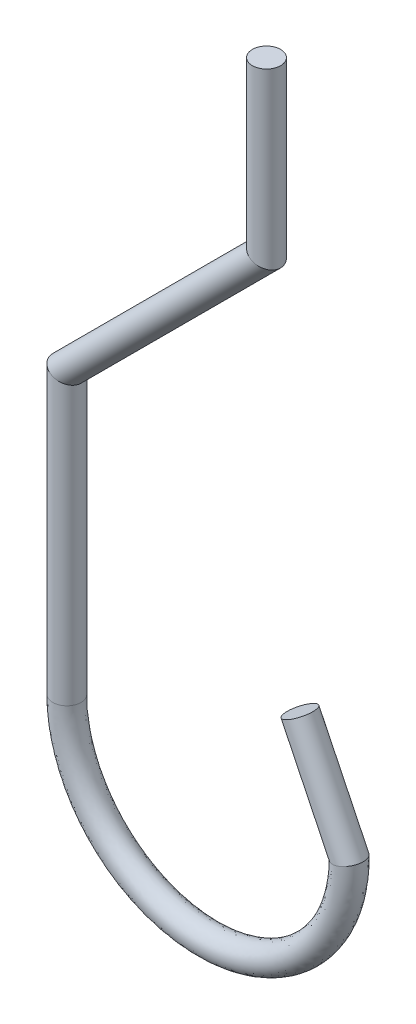
ISO-10303-21;
HEADER;
FILE_DESCRIPTION(('STEP AP214'),'2;1');
FILE_NAME('part.step','',(''),(''),'','','');
FILE_SCHEMA(('AUTOMOTIVE_DESIGN { 1 0 10303 214 1 1 1 1 }'));
ENDSEC;
DATA;
#1=APPLICATION_CONTEXT('core data for automotive mechanical design processes');
#2=APPLICATION_PROTOCOL_DEFINITION('international standard','automotive_design',2000,#1);
#3=PRODUCT_CONTEXT('',#1,'mechanical');
#4=PRODUCT('Part','Part','',(#3));
#5=PRODUCT_RELATED_PRODUCT_CATEGORY('part','',(#4));
#6=PRODUCT_DEFINITION_FORMATION('','',#4);
#7=PRODUCT_DEFINITION_CONTEXT('part definition',#1,'design');
#8=PRODUCT_DEFINITION('design','',#6,#7);
#9=PRODUCT_DEFINITION_SHAPE('','',#8);
#10=(LENGTH_UNIT() NAMED_UNIT(*) SI_UNIT(.MILLI.,.METRE.));
#11=(NAMED_UNIT(*) PLANE_ANGLE_UNIT() SI_UNIT($,.RADIAN.));
#12=(NAMED_UNIT(*) SI_UNIT($,.STERADIAN.) SOLID_ANGLE_UNIT());
#13=UNCERTAINTY_MEASURE_WITH_UNIT(LENGTH_MEASURE(1.E-05),#10,'distance_accuracy_value','');
#14=(GEOMETRIC_REPRESENTATION_CONTEXT(3) GLOBAL_UNCERTAINTY_ASSIGNED_CONTEXT((#13)) GLOBAL_UNIT_ASSIGNED_CONTEXT((#10,
#11,#12)) REPRESENTATION_CONTEXT('',''));
#15=CARTESIAN_POINT('',(0.,0.,0.));
#16=DIRECTION('',(0.,0.,1.));
#17=DIRECTION('',(1.,0.,0.));
#18=AXIS2_PLACEMENT_3D('',#15,#16,#17);
#19=CARTESIAN_POINT('',(-35.3553390593274,-65.3553390593273,0.));
#20=DIRECTION('',(0.,-1.,0.));
#21=DIRECTION('',(1.,0.,0.));
#22=AXIS2_PLACEMENT_3D('',#19,#20,#21);
#23=CYLINDRICAL_SURFACE('',#22,2.5);
#24=CARTESIAN_POINT('',(-35.3553390593274,-65.3553390593273,0.));
#25=DIRECTION('',(-0.382683432365091,-0.923879532511286,0.));
#26=DIRECTION('',(-0.923879532511286,0.382683432365091,0.));
#27=AXIS2_PLACEMENT_3D('',#24,#25,#26);
#28=ELLIPSE('',#27,2.70598050073099,2.5);
#29=CARTESIAN_POINT('',(-37.8553390593274,-64.3198051533946,0.));
#30=VERTEX_POINT('',#29);
#31=EDGE_CURVE('E12',#30,#30,#28,.T.);
#32=ORIENTED_EDGE('',*,*,#31,.T.);
#33=EDGE_LOOP('',(#32));
#34=FACE_BOUND('',#33,.T.);
#35=CARTESIAN_POINT('',(-35.3553390593274,-115.355339059327,0.));
#36=DIRECTION('',(0.,-1.,0.));
#37=DIRECTION('',(1.,0.,0.));
#38=AXIS2_PLACEMENT_3D('',#35,#36,#37);
#39=CIRCLE('',#38,2.5);
#40=CARTESIAN_POINT('',(-32.8553390593274,-115.355339059327,0.));
#41=VERTEX_POINT('',#40);
#42=EDGE_CURVE('E53',#41,#41,#39,.F.);
#43=ORIENTED_EDGE('',*,*,#42,.T.);
#44=EDGE_LOOP('',(#43));
#45=FACE_BOUND('',#44,.T.);
#46=ADVANCED_FACE('F39',(#34,#45),#23,.T.);
#47=CARTESIAN_POINT('',(0.,-30.,0.));
#48=DIRECTION('',(-0.707106781186549,-0.707106781186546,0.));
#49=DIRECTION('',(0.707106781186546,-0.707106781186549,0.));
#50=AXIS2_PLACEMENT_3D('',#47,#48,#49);
#51=CYLINDRICAL_SURFACE('',#50,2.5);
#52=CARTESIAN_POINT('',(0.,-30.,0.));
#53=DIRECTION('',(-0.382683432365091,-0.923879532511286,0.));
#54=DIRECTION('',(-0.923879532511286,0.382683432365091,0.));
#55=AXIS2_PLACEMENT_3D('',#52,#53,#54);
#56=ELLIPSE('',#55,2.70598050073099,2.5);
#57=CARTESIAN_POINT('',(-2.5,-28.9644660940673,0.));
#58=VERTEX_POINT('',#57);
#59=EDGE_CURVE('E45',#58,#58,#56,.F.);
#60=ORIENTED_EDGE('',*,*,#59,.F.);
#61=EDGE_LOOP('',(#60));
#62=FACE_BOUND('',#61,.T.);
#63=ORIENTED_EDGE('',*,*,#31,.F.);
#64=EDGE_LOOP('',(#63));
#65=FACE_BOUND('',#64,.T.);
#66=ADVANCED_FACE('F86',(#62,#65),#51,.T.);
#67=CARTESIAN_POINT('',(0.,0.,0.));
#68=DIRECTION('',(0.,1.,0.));
#69=DIRECTION('',(0.,0.,1.));
#70=AXIS2_PLACEMENT_3D('',#67,#68,#69);
#71=PLANE('',#70);
#72=CARTESIAN_POINT('',(0.,0.,0.));
#73=DIRECTION('',(0.,1.,0.));
#74=DIRECTION('',(0.,0.,1.));
#75=AXIS2_PLACEMENT_3D('',#72,#73,#74);
#76=CIRCLE('',#75,2.5);
#77=CARTESIAN_POINT('',(0.,0.,2.5));
#78=VERTEX_POINT('',#77);
#79=EDGE_CURVE('E49',#78,#78,#76,.T.);
#80=ORIENTED_EDGE('',*,*,#79,.T.);
#81=EDGE_LOOP('',(#80));
#82=FACE_BOUND('',#81,.T.);
#83=ADVANCED_FACE('F90',(#82),#71,.T.);
#84=CARTESIAN_POINT('',(0.,-37.0710678118655,0.));
#85=DIRECTION('',(0.,1.,0.));
#86=DIRECTION('',(-1.,0.,0.));
#87=AXIS2_PLACEMENT_3D('',#84,#85,#86);
#88=CYLINDRICAL_SURFACE('',#87,2.5);
#89=ORIENTED_EDGE('',*,*,#79,.F.);
#90=EDGE_LOOP('',(#89));
#91=FACE_BOUND('',#90,.T.);
#92=ORIENTED_EDGE('',*,*,#59,.T.);
#93=EDGE_LOOP('',(#92));
#94=FACE_BOUND('',#93,.T.);
#95=ADVANCED_FACE('F82',(#91,#94),#88,.T.);
#96=CARTESIAN_POINT('',(-32.8553390593274,-115.355339059327,0.));
#97=CARTESIAN_POINT('',(-32.8553390593274,-116.464848793491,0.));
#98=CARTESIAN_POINT('',(-32.7194137170249,-118.386805336152,0.));
#99=CARTESIAN_POINT('',(-32.0227368202156,-121.779781778348,0.));
#100=CARTESIAN_POINT('',(-30.664552408539,-125.310970364232,0.));
#101=CARTESIAN_POINT('',(-28.6263524869329,-128.691075626193,0.));
#102=CARTESIAN_POINT('',(-25.9955369547515,-131.674877767429,0.));
#103=CARTESIAN_POINT('',(-22.8984379080597,-134.184129596817,0.));
#104=CARTESIAN_POINT('',(-19.2158316555929,-136.185655723992,0.));
#105=CARTESIAN_POINT('',(-15.0600798109605,-137.507119957329,0.));
#106=CARTESIAN_POINT('',(-10.6402734723069,-138.002916728591,0.));
#107=CARTESIAN_POINT('',(-6.20933990120271,-137.61901563494,0.));
#108=CARTESIAN_POINT('',(-2.02172192830086,-136.403197176913,0.));
#109=CARTESIAN_POINT('',(1.71143063672208,-134.497284427214,0.));
#110=CARTESIAN_POINT('',(4.8696812389129,-132.065899606383,0.));
#111=CARTESIAN_POINT('',(7.57671904738378,-129.151003226611,0.));
#112=CARTESIAN_POINT('',(9.69825481593618,-125.823707610864,0.));
#113=CARTESIAN_POINT('',(11.1522833885691,-122.328860904178,0.));
#114=CARTESIAN_POINT('',(11.9158990143476,-118.954595111176,0.));
#115=CARTESIAN_POINT('',(12.1446609406726,-117.038665142671,0.));
#116=CARTESIAN_POINT('',(12.1446609406726,-115.928878394004,0.));
#117=CARTESIAN_POINT('',(-32.8553390593274,-115.355339059327,-5.));
#118=CARTESIAN_POINT('',(-32.8553390593274,-116.828750929578,-5.));
#119=CARTESIAN_POINT('',(-32.7194137170249,-118.195887177735,-5.));
#120=CARTESIAN_POINT('',(-32.0227368202157,-121.841101993456,-5.));
#121=CARTESIAN_POINT('',(-30.664552408539,-125.291406751237,-5.));
#122=CARTESIAN_POINT('',(-28.6263524869329,-128.695809373312,-5.));
#123=CARTESIAN_POINT('',(-25.9955369547515,-131.673589751497,-5.));
#124=CARTESIAN_POINT('',(-22.8984379080597,-134.184506177063,-5.));
#125=CARTESIAN_POINT('',(-19.2158316555929,-136.185547511496,-5.));
#126=CARTESIAN_POINT('',(-15.0600798109606,-137.50715206661,-5.));
#127=CARTESIAN_POINT('',(-10.6402734723069,-138.00290048849,-5.));
#128=CARTESIAN_POINT('',(-6.20933990120272,-137.619047851515,-5.));
#129=CARTESIAN_POINT('',(-2.02172192830085,-136.403088548053,-5.));
#130=CARTESIAN_POINT('',(1.71143063672207,-134.497662484088,-5.));
#131=CARTESIAN_POINT('',(4.8696812389129,-132.064606496469,-5.));
#132=CARTESIAN_POINT('',(7.57671904738378,-129.15575591048,-5.));
#133=CARTESIAN_POINT('',(9.69825481593619,-125.804065075985,-5.));
#134=CARTESIAN_POINT('',(11.1522833885692,-122.390430284786,-5.));
#135=CARTESIAN_POINT('',(11.9158990143476,-118.762895815371,-5.00000000000001));
#136=CARTESIAN_POINT('',(12.1446609406726,-117.404059878969,-5.));
#137=CARTESIAN_POINT('',(12.1446609406726,-115.928878394004,-5.));
#138=CARTESIAN_POINT('',(-37.8553390593274,-115.355339059327,-5.));
#139=CARTESIAN_POINT('',(-37.8553390593274,-116.828750929578,-5.));
#140=CARTESIAN_POINT('',(-37.6816464963877,-119.084800699733,-5.));
#141=CARTESIAN_POINT('',(-36.8004159575366,-123.362391518535,-5.));
#142=CARTESIAN_POINT('',(-35.0856174538301,-127.711896900218,-5.));
#143=CARTESIAN_POINT('',(-32.5288284371956,-131.877159421217,-5.));
#144=CARTESIAN_POINT('',(-29.2120798843926,-135.552398624968,-5.));
#145=CARTESIAN_POINT('',(-25.3449499044455,-138.597225616344,-5.));
#146=CARTESIAN_POINT('',(-20.7277910849168,-141.009375206802,-5.));
#147=CARTESIAN_POINT('',(-15.552334221332,-142.54488390356,-5.));
#148=CARTESIAN_POINT('',(-10.0703504115713,-143.040352597145,-5.));
#149=CARTESIAN_POINT('',(-4.59948620972261,-142.432967200906,-5.));
#150=CARTESIAN_POINT('',(0.544123308218047,-140.791774542062,-5.));
#151=CARTESIAN_POINT('',(5.11065628358608,-138.284036966686,-5.));
#152=CARTESIAN_POINT('',(8.91668613776802,-135.16127062822,-5.));
#153=CARTESIAN_POINT('',(12.1571672557414,-131.417171279379,-5.));
#154=CARTESIAN_POINT('',(14.6305954083067,-127.198977671471,-5.));
#155=CARTESIAN_POINT('',(16.2495396905664,-122.813563410938,-5.));
#156=CARTESIAN_POINT('',(17.0638081258829,-118.515900665807,-4.99999999999999));
#157=CARTESIAN_POINT('',(17.1446609406725,-116.256981209616,-5.));
#158=CARTESIAN_POINT('',(17.1446609406725,-114.781799724651,-5.));
#159=CARTESIAN_POINT('',(-37.8553390593274,-115.355339059327,0.));
#160=CARTESIAN_POINT('',(-37.8553390593274,-116.646799861534,0.));
#161=CARTESIAN_POINT('',(-37.6816464963877,-119.180259778942,0.));
#162=CARTESIAN_POINT('',(-36.8004159575367,-123.331731410981,0.));
#163=CARTESIAN_POINT('',(-35.0856174538301,-127.721678706716,0.));
#164=CARTESIAN_POINT('',(-32.5288284371956,-131.874792547657,0.));
#165=CARTESIAN_POINT('',(-29.2120798843927,-135.553042632933,0.));
#166=CARTESIAN_POINT('',(-25.3449499044455,-138.597037326221,0.));
#167=CARTESIAN_POINT('',(-20.7277910849167,-141.009429313049,0.));
#168=CARTESIAN_POINT('',(-15.552334221332,-142.544867848919,0.));
#169=CARTESIAN_POINT('',(-10.0703504115713,-143.040360717195,0.));
#170=CARTESIAN_POINT('',(-4.59948620972261,-142.432951092619,0.));
#171=CARTESIAN_POINT('',(0.544123308218034,-140.791828856492,0.));
#172=CARTESIAN_POINT('',(5.11065628358611,-138.283847938249,0.));
#173=CARTESIAN_POINT('',(8.91668613776801,-135.161917183177,0.));
#174=CARTESIAN_POINT('',(12.1571672557414,-131.414794937445,0.));
#175=CARTESIAN_POINT('',(14.6305954083067,-127.20879893891,0.));
#176=CARTESIAN_POINT('',(16.2495396905664,-122.782778720634,0.));
#177=CARTESIAN_POINT('',(17.063808125883,-118.611750313709,0.));
#178=CARTESIAN_POINT('',(17.1446609406725,-116.074283841467,0.));
#179=CARTESIAN_POINT('',(17.1446609406725,-114.781799724651,0.));
#180=CARTESIAN_POINT('',(-37.8553390593274,-115.355339059327,5.));
#181=CARTESIAN_POINT('',(-37.8553390593274,-116.464848793491,5.));
#182=CARTESIAN_POINT('',(-37.6816464963877,-119.27571885815,5.));
#183=CARTESIAN_POINT('',(-36.8004159575366,-123.301071303427,5.));
#184=CARTESIAN_POINT('',(-35.0856174538301,-127.731460513213,5.));
#185=CARTESIAN_POINT('',(-32.5288284371956,-131.872425674097,5.));
#186=CARTESIAN_POINT('',(-29.2120798843926,-135.553686640899,5.));
#187=CARTESIAN_POINT('',(-25.3449499044455,-138.596849036098,5.));
#188=CARTESIAN_POINT('',(-20.7277910849168,-141.009483419297,5.));
#189=CARTESIAN_POINT('',(-15.552334221332,-142.544851794278,5.));
#190=CARTESIAN_POINT('',(-10.0703504115713,-143.040368837245,5.));
#191=CARTESIAN_POINT('',(-4.59948620972261,-142.432934984331,5.));
#192=CARTESIAN_POINT('',(0.544123308218047,-140.791883170922,5.));
#193=CARTESIAN_POINT('',(5.11065628358608,-138.283658909812,5.));
#194=CARTESIAN_POINT('',(8.91668613776802,-135.162563738134,5.));
#195=CARTESIAN_POINT('',(12.1571672557414,-131.412418595511,5.));
#196=CARTESIAN_POINT('',(14.6305954083067,-127.21862020635,5.));
#197=CARTESIAN_POINT('',(16.2495396905664,-122.75199403033,5.));
#198=CARTESIAN_POINT('',(17.0638081258829,-118.707599961612,5.00000000000001));
#199=CARTESIAN_POINT('',(17.1446609406725,-115.891586473318,5.));
#200=CARTESIAN_POINT('',(17.1446609406725,-114.781799724651,5.));
#201=CARTESIAN_POINT('',(-32.8553390593274,-115.355339059327,5.));
#202=CARTESIAN_POINT('',(-32.8553390593274,-116.100946657404,5.));
#203=CARTESIAN_POINT('',(-32.7194137170249,-118.577723494568,5.));
#204=CARTESIAN_POINT('',(-32.0227368202157,-121.71846156324,5.));
#205=CARTESIAN_POINT('',(-30.664552408539,-125.330533977226,5.));
#206=CARTESIAN_POINT('',(-28.6263524869329,-128.686341879074,5.));
#207=CARTESIAN_POINT('',(-25.9955369547515,-131.67616578336,5.));
#208=CARTESIAN_POINT('',(-22.8984379080597,-134.183753016571,5.));
#209=CARTESIAN_POINT('',(-19.2158316555929,-136.185763936487,5.));
#210=CARTESIAN_POINT('',(-15.0600798109606,-137.507087848047,5.));
#211=CARTESIAN_POINT('',(-10.6402734723069,-138.002932968691,5.));
#212=CARTESIAN_POINT('',(-6.20933990120272,-137.618983418365,5.));
#213=CARTESIAN_POINT('',(-2.02172192830085,-136.403305805773,5.));
#214=CARTESIAN_POINT('',(1.71143063672207,-134.49690637034,5.));
#215=CARTESIAN_POINT('',(4.8696812389129,-132.067192716297,5.));
#216=CARTESIAN_POINT('',(7.57671904738378,-129.146250542742,5.));
#217=CARTESIAN_POINT('',(9.69825481593619,-125.843350145743,5.));
#218=CARTESIAN_POINT('',(11.1522833885692,-122.267291523569,5.));
#219=CARTESIAN_POINT('',(11.9158990143476,-119.14629440698,4.99999999999999));
#220=CARTESIAN_POINT('',(12.1446609406726,-116.673270406373,5.));
#221=CARTESIAN_POINT('',(12.1446609406726,-115.928878394004,5.));
#222=CARTESIAN_POINT('',(-32.8553390593274,-115.355339059327,0.));
#223=CARTESIAN_POINT('',(-32.8553390593274,-116.464848793491,0.));
#224=CARTESIAN_POINT('',(-32.7194137170249,-118.386805336152,0.));
#225=CARTESIAN_POINT('',(-32.0227368202156,-121.779781778348,0.));
#226=CARTESIAN_POINT('',(-30.664552408539,-125.310970364232,0.));
#227=CARTESIAN_POINT('',(-28.6263524869329,-128.691075626193,0.));
#228=CARTESIAN_POINT('',(-25.9955369547515,-131.674877767429,0.));
#229=CARTESIAN_POINT('',(-22.8984379080597,-134.184129596817,0.));
#230=CARTESIAN_POINT('',(-19.2158316555929,-136.185655723992,0.));
#231=CARTESIAN_POINT('',(-15.0600798109605,-137.507119957329,0.));
#232=CARTESIAN_POINT('',(-10.6402734723069,-138.002916728591,0.));
#233=CARTESIAN_POINT('',(-6.20933990120271,-137.61901563494,0.));
#234=CARTESIAN_POINT('',(-2.02172192830086,-136.403197176913,0.));
#235=CARTESIAN_POINT('',(1.71143063672208,-134.497284427214,0.));
#236=CARTESIAN_POINT('',(4.8696812389129,-132.065899606383,0.));
#237=CARTESIAN_POINT('',(7.57671904738378,-129.151003226611,0.));
#238=CARTESIAN_POINT('',(9.69825481593618,-125.823707610864,0.));
#239=CARTESIAN_POINT('',(11.1522833885691,-122.328860904178,0.));
#240=CARTESIAN_POINT('',(11.9158990143476,-118.954595111176,0.));
#241=CARTESIAN_POINT('',(12.1446609406726,-117.038665142671,0.));
#242=CARTESIAN_POINT('',(12.1446609406726,-115.928878394004,0.));
#243=(BOUNDED_SURFACE() B_SPLINE_SURFACE(3,3,((#96,#97,#98,#99,#100,#101,#102,#103,#104,#105,
#106,#107,#108,#109,#110,#111,#112,#113,#114,#115,#116),(#117,#118,#119,#120,#121,#122,#123,
#124,#125,#126,#127,#128,#129,#130,#131,#132,#133,#134,#135,#136,#137),(#138,#139,#140,#141,
#142,#143,#144,#145,#146,#147,#148,#149,#150,#151,#152,#153,#154,#155,#156,#157,#158),(#159,
#160,#161,#162,#163,#164,#165,#166,#167,#168,#169,#170,#171,#172,#173,#174,#175,#176,#177,#178,
#179),(#180,#181,#182,#183,#184,#185,#186,#187,#188,#189,#190,#191,#192,#193,#194,#195,#196,
#197,#198,#199,#200),(#201,#202,#203,#204,#205,#206,#207,#208,#209,#210,#211,#212,#213,#214,
#215,#216,#217,#218,#219,#220,#221),(#222,#223,#224,#225,#226,#227,#228,#229,#230,#231,#232,
#233,#234,#235,#236,#237,#238,#239,#240,#241,#242)),.UNSPECIFIED.,.T.,.F.,
.F.) B_SPLINE_SURFACE_WITH_KNOTS((4,3,4),(4,1,1,1,1,1,1,1,1,1,1,1,1,1,1,1,1,1,4),(0.,0.5,1.),
(0.,0.0424207787533702,0.0903540991872726,0.1444749119382,0.204847670294582,0.25786075619066,
0.314507249769556,0.374337251760054,0.436535948572148,0.499974771829061,0.563414286869587,
0.625615178927382,0.685448987468962,0.742100080617022,0.795119115678433,0.855500119431893,
0.909629368138061,0.957571222515,1.),
.UNSPECIFIED.) GEOMETRIC_REPRESENTATION_ITEM() RATIONAL_B_SPLINE_SURFACE(((1.,1.,1.,1.,1.,1.,1.,
1.,1.,1.,1.,1.,1.,1.,1.,1.,1.,1.,1.,1.,1.),(0.333333333333333,0.333333333333333,
0.333333333333333,0.333333333333333,0.333333333333333,0.333333333333333,0.333333333333333,
0.333333333333333,0.333333333333333,0.333333333333333,0.333333333333333,0.333333333333333,
0.333333333333333,0.333333333333333,0.333333333333333,0.333333333333333,0.333333333333333,
0.333333333333333,0.333333333333333,0.333333333333333,0.333333333333333),(0.333333333333333,
0.333333333333333,0.333333333333333,0.333333333333333,0.333333333333333,0.333333333333333,
0.333333333333333,0.333333333333333,0.333333333333333,0.333333333333333,0.333333333333333,
0.333333333333333,0.333333333333333,0.333333333333333,0.333333333333333,0.333333333333333,
0.333333333333333,0.333333333333333,0.333333333333333,0.333333333333333,0.333333333333333),(1.,
1.,1.,1.,1.,1.,1.,1.,1.,1.,1.,1.,1.,1.,1.,1.,1.,1.,1.,1.,1.),(0.333333333333333,
0.333333333333333,0.333333333333333,0.333333333333333,0.333333333333333,0.333333333333333,
0.333333333333333,0.333333333333333,0.333333333333333,0.333333333333333,0.333333333333333,
0.333333333333333,0.333333333333333,0.333333333333333,0.333333333333333,0.333333333333333,
0.333333333333333,0.333333333333333,0.333333333333333,0.333333333333333,0.333333333333333),
(0.333333333333333,0.333333333333333,0.333333333333333,0.333333333333333,0.333333333333333,
0.333333333333333,0.333333333333333,0.333333333333333,0.333333333333333,0.333333333333333,
0.333333333333333,0.333333333333333,0.333333333333333,0.333333333333333,0.333333333333333,
0.333333333333333,0.333333333333333,0.333333333333333,0.333333333333333,0.333333333333333,
0.333333333333333),(1.,1.,1.,1.,1.,1.,1.,1.,1.,1.,1.,1.,1.,1.,1.,1.,1.,1.,1.,1.,1.))) REPRESENTATION_ITEM('') SURFACE());
#244=CARTESIAN_POINT('',(12.1446609406726,-115.928878394004,0.));
#245=CARTESIAN_POINT('',(12.1446609406726,-115.928878394004,-5.));
#246=CARTESIAN_POINT('',(17.1446609406725,-114.781799724651,-5.));
#247=CARTESIAN_POINT('',(17.1446609406725,-114.781799724651,0.));
#248=CARTESIAN_POINT('',(17.1446609406725,-114.781799724651,5.));
#249=CARTESIAN_POINT('',(12.1446609406726,-115.928878394004,5.));
#250=CARTESIAN_POINT('',(12.1446609406726,-115.928878394004,0.));
#251=(BOUNDED_CURVE() B_SPLINE_CURVE(3,(#244,#245,#246,#247,#248,#249,#250),.UNSPECIFIED.,.T.,
.F.) B_SPLINE_CURVE_WITH_KNOTS((4,3,4),(0.,0.5,1.),
.UNSPECIFIED.) CURVE() GEOMETRIC_REPRESENTATION_ITEM() RATIONAL_B_SPLINE_CURVE((1.,
0.333333333333333,0.333333333333333,1.,0.333333333333333,0.333333333333333,1.)) REPRESENTATION_ITEM(''));
#252=CARTESIAN_POINT('',(12.1446609406726,-115.928878394004,0.));
#253=VERTEX_POINT('',#252);
#254=EDGE_CURVE('E58',#253,#253,#251,.F.);
#255=ORIENTED_EDGE('',*,*,#42,.F.);
#256=EDGE_LOOP('',(#255));
#257=FACE_BOUND('',#256,.T.);
#258=ORIENTED_EDGE('',*,*,#254,.F.);
#259=EDGE_LOOP('',(#258));
#260=FACE_BOUND('',#259,.T.);
#261=ADVANCED_FACE('F74',(#257,#260),#243,.F.);
#262=CARTESIAN_POINT('',(8.17686305359116,-96.2656143234422,0.));
#263=DIRECTION('',(0.435889894354069,-0.899999999999999,0.));
#264=DIRECTION('',(0.899999999999999,0.435889894354069,0.));
#265=AXIS2_PLACEMENT_3D('',#262,#263,#264);
#266=PLANE('',#265);
#267=CARTESIAN_POINT('',(5.92686305359122,-97.3553390593273,0.));
#268=DIRECTION('',(0.435889894354069,-0.899999999999999,0.));
#269=DIRECTION('',(0.899999999999999,0.435889894354069,0.));
#270=AXIS2_PLACEMENT_3D('',#267,#268,#269);
#271=CIRCLE('',#270,2.49999999999994);
#272=CARTESIAN_POINT('',(8.17686305359116,-96.2656143234422,0.));
#273=VERTEX_POINT('',#272);
#274=EDGE_CURVE('E63',#273,#273,#271,.T.);
#275=ORIENTED_EDGE('',*,*,#274,.F.);
#276=EDGE_LOOP('',(#275));
#277=FACE_BOUND('',#276,.T.);
#278=ADVANCED_FACE('F72',(#277),#266,.F.);
#279=CARTESIAN_POINT('',(12.1446609406726,-115.928878394004,0.));
#280=CARTESIAN_POINT('',(3.67686305359128,-98.4450637952124,0.));
#281=CARTESIAN_POINT('',(12.1446609406726,-115.928878394004,5.));
#282=CARTESIAN_POINT('',(3.67686305359128,-98.4450637952124,5.));
#283=CARTESIAN_POINT('',(17.1446609406725,-114.781799724651,5.));
#284=CARTESIAN_POINT('',(8.17686305359117,-96.2656143234422,5.));
#285=CARTESIAN_POINT('',(17.1446609406725,-114.781799724651,0.));
#286=CARTESIAN_POINT('',(8.17686305359116,-96.2656143234422,0.));
#287=CARTESIAN_POINT('',(17.1446609406725,-114.781799724651,-5.));
#288=CARTESIAN_POINT('',(8.17686305359117,-96.2656143234422,-5.));
#289=CARTESIAN_POINT('',(12.1446609406726,-115.928878394004,-5.));
#290=CARTESIAN_POINT('',(3.67686305359128,-98.4450637952124,-5.));
#291=CARTESIAN_POINT('',(12.1446609406726,-115.928878394004,0.));
#292=CARTESIAN_POINT('',(3.67686305359128,-98.4450637952124,0.));
#293=(BOUNDED_SURFACE() B_SPLINE_SURFACE(3,1,((#279,#280),(#281,#282),(#283,#284),(#285,#286),
(#287,#288),(#289,#290),(#291,#292)),.UNSPECIFIED.,.T.,.F.,.F.) B_SPLINE_SURFACE_WITH_KNOTS((4,
3,4),(2,2),(0.,0.5,1.),(0.,1.),
.UNSPECIFIED.) GEOMETRIC_REPRESENTATION_ITEM() RATIONAL_B_SPLINE_SURFACE(((1.,1.),
(0.333333333333333,0.333333333333333),(0.333333333333333,0.333333333333333),(1.,1.),
(0.333333333333333,0.333333333333333),(0.333333333333333,0.333333333333333),(1.,1.))) REPRESENTATION_ITEM('') SURFACE());
#294=ORIENTED_EDGE('',*,*,#254,.T.);
#295=EDGE_LOOP('',(#294));
#296=FACE_BOUND('',#295,.T.);
#297=ORIENTED_EDGE('',*,*,#274,.T.);
#298=EDGE_LOOP('',(#297));
#299=FACE_BOUND('',#298,.T.);
#300=ADVANCED_FACE('F70',(#296,#299),#293,.T.);
#301=CLOSED_SHELL('',(#46,#66,#83,#95,#261,#278,#300));
#302=MANIFOLD_SOLID_BREP('B2',#301);
#303=ADVANCED_BREP_SHAPE_REPRESENTATION('',(#18,#302),#14);
#304=SHAPE_DEFINITION_REPRESENTATION(#9,#303);
ENDSEC;
END-ISO-10303-21;
